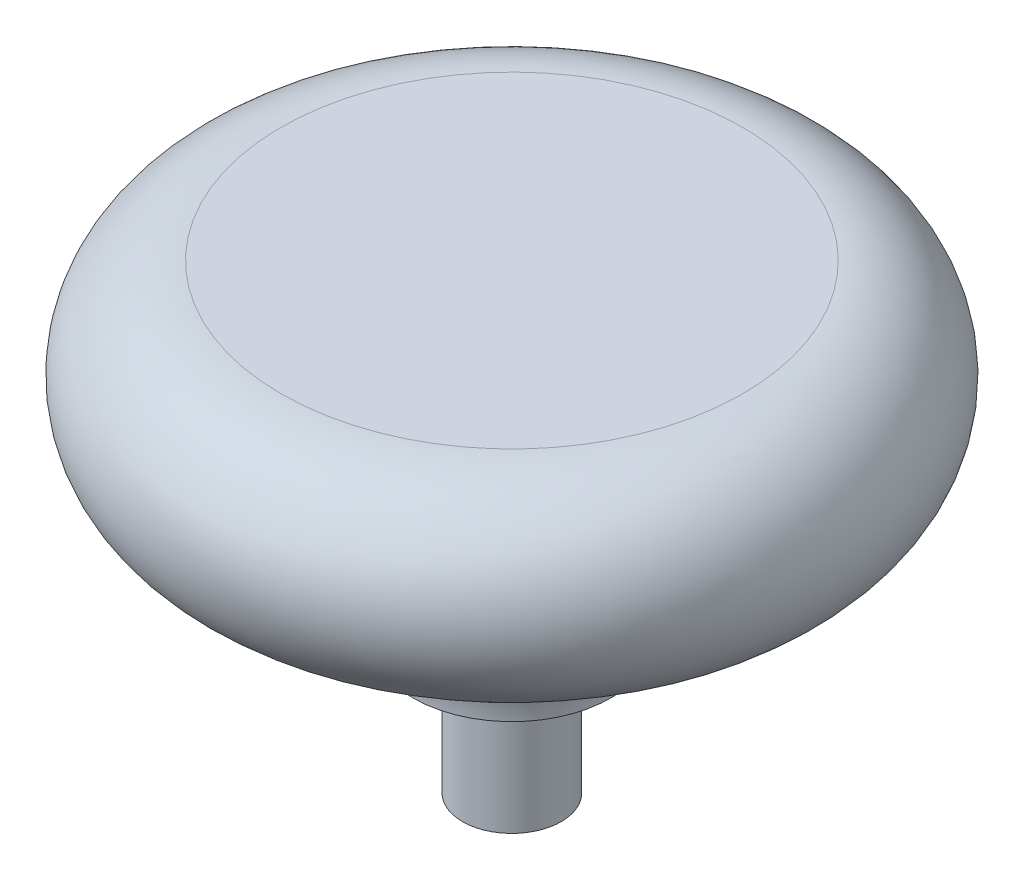
ISO-10303-21;
HEADER;
FILE_DESCRIPTION(('STEP AP214'),'2;1');
FILE_NAME('part.step','',(''),(''),'','','');
FILE_SCHEMA(('AUTOMOTIVE_DESIGN { 1 0 10303 214 1 1 1 1 }'));
ENDSEC;
DATA;
#1=APPLICATION_CONTEXT('core data for automotive mechanical design processes');
#2=APPLICATION_PROTOCOL_DEFINITION('international standard','automotive_design',2000,#1);
#3=PRODUCT_CONTEXT('',#1,'mechanical');
#4=PRODUCT('Part','Part','',(#3));
#5=PRODUCT_RELATED_PRODUCT_CATEGORY('part','',(#4));
#6=PRODUCT_DEFINITION_FORMATION('','',#4);
#7=PRODUCT_DEFINITION_CONTEXT('part definition',#1,'design');
#8=PRODUCT_DEFINITION('design','',#6,#7);
#9=PRODUCT_DEFINITION_SHAPE('','',#8);
#10=(LENGTH_UNIT() NAMED_UNIT(*) SI_UNIT(.MILLI.,.METRE.));
#11=(NAMED_UNIT(*) PLANE_ANGLE_UNIT() SI_UNIT($,.RADIAN.));
#12=(NAMED_UNIT(*) SI_UNIT($,.STERADIAN.) SOLID_ANGLE_UNIT());
#13=UNCERTAINTY_MEASURE_WITH_UNIT(LENGTH_MEASURE(1.E-05),#10,'distance_accuracy_value','');
#14=(GEOMETRIC_REPRESENTATION_CONTEXT(3) GLOBAL_UNCERTAINTY_ASSIGNED_CONTEXT((#13)) GLOBAL_UNIT_ASSIGNED_CONTEXT((#10,
#11,#12)) REPRESENTATION_CONTEXT('',''));
#15=CARTESIAN_POINT('',(0.,0.,0.));
#16=DIRECTION('',(0.,0.,1.));
#17=DIRECTION('',(1.,0.,0.));
#18=AXIS2_PLACEMENT_3D('',#15,#16,#17);
#19=CARTESIAN_POINT('',(0.,-4.75999803149575,0.));
#20=DIRECTION('',(0.,1.,0.));
#21=DIRECTION('',(0.,0.,1.));
#22=AXIS2_PLACEMENT_3D('',#19,#20,#21);
#23=TOROIDAL_SURFACE('',#22,11.1149999999997,6.34999999999999);
#24=CARTESIAN_POINT('',(0.,1.59,0.));
#25=DIRECTION('',(0.,1.,0.));
#26=DIRECTION('',(0.,0.,1.));
#27=AXIS2_PLACEMENT_3D('',#24,#25,#26);
#28=CIRCLE('',#27,11.12);
#29=CARTESIAN_POINT('',(0.,1.59,11.12));
#30=VERTEX_POINT('',#29);
#31=EDGE_CURVE('E62',#30,#30,#28,.T.);
#32=ORIENTED_EDGE('',*,*,#31,.F.);
#33=EDGE_LOOP('',(#32));
#34=FACE_BOUND('',#33,.T.);
#35=CARTESIAN_POINT('',(0.,-4.76,0.));
#36=DIRECTION('',(0.,1.,0.));
#37=DIRECTION('',(0.,0.,1.));
#38=AXIS2_PLACEMENT_3D('',#35,#36,#37);
#39=CIRCLE('',#38,4.765);
#40=CARTESIAN_POINT('',(0.,-4.76,4.765));
#41=VERTEX_POINT('',#40);
#42=EDGE_CURVE('E10',#41,#41,#39,.T.);
#43=ORIENTED_EDGE('',*,*,#42,.T.);
#44=EDGE_LOOP('',(#43));
#45=FACE_BOUND('',#44,.T.);
#46=ADVANCED_FACE('F39',(#34,#45),#23,.F.);
#47=CARTESIAN_POINT('',(2.38,-4.76,0.));
#48=DIRECTION('',(0.,1.,0.));
#49=DIRECTION('',(0.,0.,1.));
#50=AXIS2_PLACEMENT_3D('',#47,#48,#49);
#51=PLANE('',#50);
#52=ORIENTED_EDGE('',*,*,#42,.F.);
#53=EDGE_LOOP('',(#52));
#54=FACE_BOUND('',#53,.T.);
#55=CARTESIAN_POINT('',(0.,-4.76,0.));
#56=DIRECTION('',(0.,1.,0.));
#57=DIRECTION('',(0.,0.,1.));
#58=AXIS2_PLACEMENT_3D('',#55,#56,#57);
#59=CIRCLE('',#58,2.38);
#60=CARTESIAN_POINT('',(0.,-4.76,2.38));
#61=VERTEX_POINT('',#60);
#62=EDGE_CURVE('E46',#61,#61,#59,.T.);
#63=ORIENTED_EDGE('',*,*,#62,.T.);
#64=EDGE_LOOP('',(#63));
#65=FACE_BOUND('',#64,.T.);
#66=ADVANCED_FACE('F70',(#54,#65),#51,.F.);
#67=CARTESIAN_POINT('',(0.,36.660350877193,0.));
#68=DIRECTION('',(0.,1.,0.));
#69=DIRECTION('',(0.,0.,1.));
#70=AXIS2_PLACEMENT_3D('',#67,#68,#69);
#71=CYLINDRICAL_SURFACE('',#70,2.38);
#72=ORIENTED_EDGE('',*,*,#62,.F.);
#73=EDGE_LOOP('',(#72));
#74=FACE_BOUND('',#73,.T.);
#75=CARTESIAN_POINT('',(0.,-11.11,0.));
#76=DIRECTION('',(0.,1.,0.));
#77=DIRECTION('',(0.,0.,1.));
#78=AXIS2_PLACEMENT_3D('',#75,#76,#77);
#79=CIRCLE('',#78,2.38);
#80=CARTESIAN_POINT('',(0.,-11.11,2.38));
#81=VERTEX_POINT('',#80);
#82=EDGE_CURVE('E51',#81,#81,#79,.T.);
#83=ORIENTED_EDGE('',*,*,#82,.T.);
#84=EDGE_LOOP('',(#83));
#85=FACE_BOUND('',#84,.T.);
#86=ADVANCED_FACE('F74',(#74,#85),#71,.T.);
#87=CARTESIAN_POINT('',(0.,-11.11,0.));
#88=DIRECTION('',(0.,1.,0.));
#89=DIRECTION('',(0.,0.,1.));
#90=AXIS2_PLACEMENT_3D('',#87,#88,#89);
#91=PLANE('',#90);
#92=ORIENTED_EDGE('',*,*,#82,.F.);
#93=EDGE_LOOP('',(#92));
#94=FACE_BOUND('',#93,.T.);
#95=ADVANCED_FACE('F79',(#94),#91,.F.);
#96=CARTESIAN_POINT('',(11.12,11.11,0.));
#97=DIRECTION('',(0.,-1.,0.));
#98=DIRECTION('',(0.,0.,-1.));
#99=AXIS2_PLACEMENT_3D('',#96,#97,#98);
#100=PLANE('',#99);
#101=CARTESIAN_POINT('',(0.,11.11,0.));
#102=DIRECTION('',(0.,1.,0.));
#103=DIRECTION('',(0.,0.,1.));
#104=AXIS2_PLACEMENT_3D('',#101,#102,#103);
#105=CIRCLE('',#104,11.12);
#106=CARTESIAN_POINT('',(0.,11.11,11.12));
#107=VERTEX_POINT('',#106);
#108=EDGE_CURVE('E56',#107,#107,#105,.T.);
#109=ORIENTED_EDGE('',*,*,#108,.T.);
#110=EDGE_LOOP('',(#109));
#111=FACE_BOUND('',#110,.T.);
#112=ADVANCED_FACE('F85',(#111),#100,.F.);
#113=CARTESIAN_POINT('',(0.,6.35,0.));
#114=DIRECTION('',(0.,1.,0.));
#115=DIRECTION('',(0.,0.,1.));
#116=AXIS2_PLACEMENT_3D('',#113,#114,#115);
#117=TOROIDAL_SURFACE('',#116,11.12,4.76);
#118=ORIENTED_EDGE('',*,*,#108,.F.);
#119=EDGE_LOOP('',(#118));
#120=FACE_BOUND('',#119,.T.);
#121=ORIENTED_EDGE('',*,*,#31,.T.);
#122=EDGE_LOOP('',(#121));
#123=FACE_BOUND('',#122,.T.);
#124=ADVANCED_FACE('F67',(#120,#123),#117,.T.);
#125=CLOSED_SHELL('',(#46,#66,#86,#95,#112,#124));
#126=MANIFOLD_SOLID_BREP('B2',#125);
#127=ADVANCED_BREP_SHAPE_REPRESENTATION('',(#18,#126),#14);
#128=SHAPE_DEFINITION_REPRESENTATION(#9,#127);
ENDSEC;
END-ISO-10303-21;
